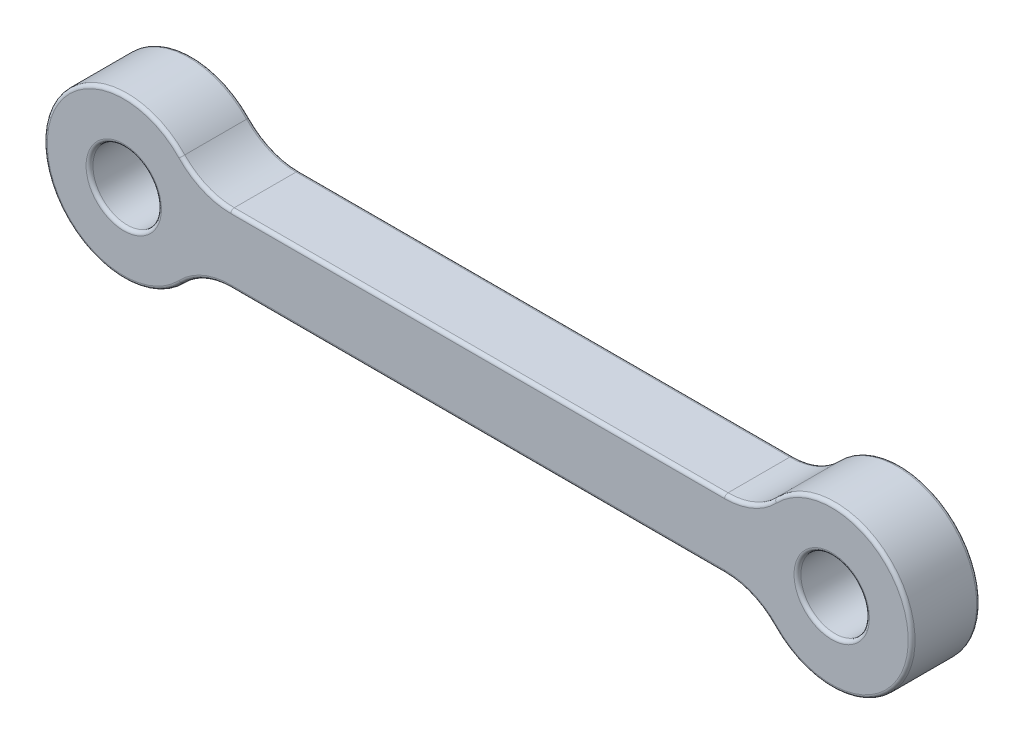
ISO-10303-21;
HEADER;
FILE_DESCRIPTION(('STEP AP214'),'2;1');
FILE_NAME('part.step','',(''),(''),'','','');
FILE_SCHEMA(('AUTOMOTIVE_DESIGN { 1 0 10303 214 1 1 1 1 }'));
ENDSEC;
DATA;
#1=APPLICATION_CONTEXT('core data for automotive mechanical design processes');
#2=APPLICATION_PROTOCOL_DEFINITION('international standard','automotive_design',2000,#1);
#3=PRODUCT_CONTEXT('',#1,'mechanical');
#4=PRODUCT('Part','Part','',(#3));
#5=PRODUCT_RELATED_PRODUCT_CATEGORY('part','',(#4));
#6=PRODUCT_DEFINITION_FORMATION('','',#4);
#7=PRODUCT_DEFINITION_CONTEXT('part definition',#1,'design');
#8=PRODUCT_DEFINITION('design','',#6,#7);
#9=PRODUCT_DEFINITION_SHAPE('','',#8);
#10=(LENGTH_UNIT() NAMED_UNIT(*) SI_UNIT(.MILLI.,.METRE.));
#11=(NAMED_UNIT(*) PLANE_ANGLE_UNIT() SI_UNIT($,.RADIAN.));
#12=(NAMED_UNIT(*) SI_UNIT($,.STERADIAN.) SOLID_ANGLE_UNIT());
#13=UNCERTAINTY_MEASURE_WITH_UNIT(LENGTH_MEASURE(1.E-05),#10,'distance_accuracy_value','');
#14=(GEOMETRIC_REPRESENTATION_CONTEXT(3) GLOBAL_UNCERTAINTY_ASSIGNED_CONTEXT((#13)) GLOBAL_UNIT_ASSIGNED_CONTEXT((#10,
#11,#12)) REPRESENTATION_CONTEXT('',''));
#15=CARTESIAN_POINT('',(0.,0.,0.));
#16=DIRECTION('',(0.,0.,1.));
#17=DIRECTION('',(1.,0.,0.));
#18=AXIS2_PLACEMENT_3D('',#15,#16,#17);
#19=CARTESIAN_POINT('',(0.,1.5,1.5));
#20=DIRECTION('',(0.,1.,0.));
#21=DIRECTION('',(0.,0.,1.));
#22=AXIS2_PLACEMENT_3D('',#19,#20,#21);
#23=PLANE('',#22);
#24=DIRECTION('',(0.,0.,1.));
#25=VECTOR('',#24,1.);
#26=CARTESIAN_POINT('',(26.3095842401766,1.5,-1.5));
#27=LINE('',#26,#25);
#28=CARTESIAN_POINT('',(26.3095842401766,1.5,1.35));
#29=VERTEX_POINT('',#28);
#30=CARTESIAN_POINT('',(26.3095842401766,1.5,-1.35));
#31=VERTEX_POINT('',#30);
#32=EDGE_CURVE('E315',#29,#31,#27,.F.);
#33=ORIENTED_EDGE('',*,*,#32,.T.);
#34=DIRECTION('',(1.,0.,0.));
#35=VECTOR('',#34,1.);
#36=CARTESIAN_POINT('',(4.69041575982343,1.5,-1.35));
#37=LINE('',#36,#35);
#38=CARTESIAN_POINT('',(4.69041575982343,1.5,-1.35));
#39=VERTEX_POINT('',#38);
#40=EDGE_CURVE('E214',#31,#39,#37,.F.);
#41=ORIENTED_EDGE('',*,*,#40,.T.);
#42=DIRECTION('',(0.,0.,-1.));
#43=VECTOR('',#42,1.);
#44=CARTESIAN_POINT('',(4.69041575982343,1.5,1.5));
#45=LINE('',#44,#43);
#46=CARTESIAN_POINT('',(4.69041575982343,1.5,1.35));
#47=VERTEX_POINT('',#46);
#48=EDGE_CURVE('E312',#39,#47,#45,.F.);
#49=ORIENTED_EDGE('',*,*,#48,.T.);
#50=DIRECTION('',(1.,0.,0.));
#51=VECTOR('',#50,1.);
#52=CARTESIAN_POINT('',(0.,1.5,1.35));
#53=LINE('',#52,#51);
#54=EDGE_CURVE('E212',#47,#29,#53,.T.);
#55=ORIENTED_EDGE('',*,*,#54,.T.);
#56=EDGE_LOOP('',(#33,#41,#49,#55));
#57=FACE_BOUND('',#56,.T.);
#58=ADVANCED_FACE('F34',(#57),#23,.T.);
#59=CARTESIAN_POINT('',(0.,0.,1.5));
#60=DIRECTION('',(0.,0.,-1.));
#61=DIRECTION('',(-1.,0.,0.));
#62=AXIS2_PLACEMENT_3D('',#59,#60,#61);
#63=CYLINDRICAL_SURFACE('',#62,3.5);
#64=DIRECTION('',(0.,0.,-1.));
#65=VECTOR('',#64,1.);
#66=CARTESIAN_POINT('',(2.52560848605877,2.42307692307692,1.5));
#67=LINE('',#66,#65);
#68=CARTESIAN_POINT('',(2.52560848605877,2.42307692307692,1.35));
#69=VERTEX_POINT('',#68);
#70=CARTESIAN_POINT('',(2.52560848605877,2.42307692307692,-1.35));
#71=VERTEX_POINT('',#70);
#72=EDGE_CURVE('E302',#69,#71,#67,.T.);
#73=ORIENTED_EDGE('',*,*,#72,.T.);
#74=CARTESIAN_POINT('',(0.,0.,-1.35));
#75=DIRECTION('',(0.,0.,1.));
#76=DIRECTION('',(1.,0.,0.));
#77=AXIS2_PLACEMENT_3D('',#74,#75,#76);
#78=CIRCLE('',#77,3.5);
#79=CARTESIAN_POINT('',(2.52560848605877,-2.42307692307692,-1.35));
#80=VERTEX_POINT('',#79);
#81=EDGE_CURVE('E222',#71,#80,#78,.T.);
#82=ORIENTED_EDGE('',*,*,#81,.T.);
#83=DIRECTION('',(0.,0.,-1.));
#84=VECTOR('',#83,1.);
#85=CARTESIAN_POINT('',(2.52560848605877,-2.42307692307692,1.5));
#86=LINE('',#85,#84);
#87=CARTESIAN_POINT('',(2.52560848605877,-2.42307692307692,1.35));
#88=VERTEX_POINT('',#87);
#89=EDGE_CURVE('E294',#80,#88,#86,.F.);
#90=ORIENTED_EDGE('',*,*,#89,.T.);
#91=CARTESIAN_POINT('',(0.,0.,1.35));
#92=DIRECTION('',(0.,0.,1.));
#93=DIRECTION('',(1.,0.,0.));
#94=AXIS2_PLACEMENT_3D('',#91,#92,#93);
#95=CIRCLE('',#94,3.5);
#96=EDGE_CURVE('E220',#88,#69,#95,.F.);
#97=ORIENTED_EDGE('',*,*,#96,.T.);
#98=EDGE_LOOP('',(#73,#82,#90,#97));
#99=FACE_BOUND('',#98,.T.);
#100=ADVANCED_FACE('F299',(#99),#63,.T.);
#101=CARTESIAN_POINT('',(0.,-1.5,1.5));
#102=DIRECTION('',(0.,1.,0.));
#103=DIRECTION('',(0.,0.,1.));
#104=AXIS2_PLACEMENT_3D('',#101,#102,#103);
#105=PLANE('',#104);
#106=DIRECTION('',(0.,0.,1.));
#107=VECTOR('',#106,1.);
#108=CARTESIAN_POINT('',(4.69041575982343,-1.5,-1.5));
#109=LINE('',#108,#107);
#110=CARTESIAN_POINT('',(4.69041575982343,-1.5,1.35));
#111=VERTEX_POINT('',#110);
#112=CARTESIAN_POINT('',(4.69041575982343,-1.5,-1.35));
#113=VERTEX_POINT('',#112);
#114=EDGE_CURVE('E296',#111,#113,#109,.F.);
#115=ORIENTED_EDGE('',*,*,#114,.T.);
#116=DIRECTION('',(1.,0.,0.));
#117=VECTOR('',#116,1.);
#118=CARTESIAN_POINT('',(0.,-1.5,-1.35));
#119=LINE('',#118,#117);
#120=CARTESIAN_POINT('',(26.3095842401766,-1.5,-1.35));
#121=VERTEX_POINT('',#120);
#122=EDGE_CURVE('E197',#113,#121,#119,.T.);
#123=ORIENTED_EDGE('',*,*,#122,.T.);
#124=DIRECTION('',(0.,0.,-1.));
#125=VECTOR('',#124,1.);
#126=CARTESIAN_POINT('',(26.3095842401766,-1.5,1.5));
#127=LINE('',#126,#125);
#128=CARTESIAN_POINT('',(26.3095842401766,-1.5,1.35));
#129=VERTEX_POINT('',#128);
#130=EDGE_CURVE('E257',#121,#129,#127,.F.);
#131=ORIENTED_EDGE('',*,*,#130,.T.);
#132=DIRECTION('',(1.,0.,0.));
#133=VECTOR('',#132,1.);
#134=CARTESIAN_POINT('',(4.69041575982343,-1.5,1.35));
#135=LINE('',#134,#133);
#136=EDGE_CURVE('E195',#129,#111,#135,.F.);
#137=ORIENTED_EDGE('',*,*,#136,.T.);
#138=EDGE_LOOP('',(#115,#123,#131,#137));
#139=FACE_BOUND('',#138,.T.);
#140=ADVANCED_FACE('F342',(#139),#105,.F.);
#141=CARTESIAN_POINT('',(0.,0.,1.5));
#142=DIRECTION('',(0.,0.,-1.));
#143=DIRECTION('',(-1.,0.,0.));
#144=AXIS2_PLACEMENT_3D('',#141,#142,#143);
#145=CYLINDRICAL_SURFACE('',#144,1.5);
#146=CARTESIAN_POINT('',(0.,0.,-1.35));
#147=DIRECTION('',(0.,0.,1.));
#148=DIRECTION('',(1.,0.,0.));
#149=AXIS2_PLACEMENT_3D('',#146,#147,#148);
#150=CIRCLE('',#149,1.5);
#151=CARTESIAN_POINT('',(1.5,0.,-1.35));
#152=VERTEX_POINT('',#151);
#153=EDGE_CURVE('E189',#152,#152,#150,.F.);
#154=ORIENTED_EDGE('',*,*,#153,.T.);
#155=EDGE_LOOP('',(#154));
#156=FACE_BOUND('',#155,.T.);
#157=CARTESIAN_POINT('',(0.,0.,1.35));
#158=DIRECTION('',(0.,0.,1.));
#159=DIRECTION('',(1.,0.,0.));
#160=AXIS2_PLACEMENT_3D('',#157,#158,#159);
#161=CIRCLE('',#160,1.5);
#162=CARTESIAN_POINT('',(1.5,0.,1.35));
#163=VERTEX_POINT('',#162);
#164=EDGE_CURVE('E186',#163,#163,#161,.T.);
#165=ORIENTED_EDGE('',*,*,#164,.T.);
#166=EDGE_LOOP('',(#165));
#167=FACE_BOUND('',#166,.T.);
#168=ADVANCED_FACE('F389',(#156,#167),#145,.F.);
#169=CARTESIAN_POINT('',(31.,0.,1.5));
#170=DIRECTION('',(0.,0.,-1.));
#171=DIRECTION('',(-1.,0.,0.));
#172=AXIS2_PLACEMENT_3D('',#169,#170,#171);
#173=CYLINDRICAL_SURFACE('',#172,3.5);
#174=DIRECTION('',(0.,0.,-1.));
#175=VECTOR('',#174,1.);
#176=CARTESIAN_POINT('',(28.4743915139412,-2.42307692307692,1.5));
#177=LINE('',#176,#175);
#178=CARTESIAN_POINT('',(28.4743915139412,-2.42307692307692,1.35));
#179=VERTEX_POINT('',#178);
#180=CARTESIAN_POINT('',(28.4743915139412,-2.42307692307692,-1.35));
#181=VERTEX_POINT('',#180);
#182=EDGE_CURVE('E305',#179,#181,#177,.T.);
#183=ORIENTED_EDGE('',*,*,#182,.T.);
#184=CARTESIAN_POINT('',(31.,0.,-1.35));
#185=DIRECTION('',(0.,0.,1.));
#186=DIRECTION('',(1.,0.,0.));
#187=AXIS2_PLACEMENT_3D('',#184,#185,#186);
#188=CIRCLE('',#187,3.5);
#189=CARTESIAN_POINT('',(28.4743915139412,2.42307692307692,-1.35));
#190=VERTEX_POINT('',#189);
#191=EDGE_CURVE('E205',#181,#190,#188,.T.);
#192=ORIENTED_EDGE('',*,*,#191,.T.);
#193=DIRECTION('',(0.,0.,-1.));
#194=VECTOR('',#193,1.);
#195=CARTESIAN_POINT('',(28.4743915139412,2.42307692307692,1.5));
#196=LINE('',#195,#194);
#197=CARTESIAN_POINT('',(28.4743915139412,2.42307692307692,1.35));
#198=VERTEX_POINT('',#197);
#199=EDGE_CURVE('E301',#190,#198,#196,.F.);
#200=ORIENTED_EDGE('',*,*,#199,.T.);
#201=CARTESIAN_POINT('',(31.,0.,1.35));
#202=DIRECTION('',(0.,0.,1.));
#203=DIRECTION('',(1.,0.,0.));
#204=AXIS2_PLACEMENT_3D('',#201,#202,#203);
#205=CIRCLE('',#204,3.5);
#206=EDGE_CURVE('E203',#198,#179,#205,.F.);
#207=ORIENTED_EDGE('',*,*,#206,.T.);
#208=EDGE_LOOP('',(#183,#192,#200,#207));
#209=FACE_BOUND('',#208,.T.);
#210=ADVANCED_FACE('F386',(#209),#173,.T.);
#211=CARTESIAN_POINT('',(31.,0.,1.5));
#212=DIRECTION('',(0.,0.,-1.));
#213=DIRECTION('',(-1.,0.,0.));
#214=AXIS2_PLACEMENT_3D('',#211,#212,#213);
#215=CYLINDRICAL_SURFACE('',#214,1.5);
#216=CARTESIAN_POINT('',(31.,0.,-1.35));
#217=DIRECTION('',(0.,0.,1.));
#218=DIRECTION('',(1.,0.,0.));
#219=AXIS2_PLACEMENT_3D('',#216,#217,#218);
#220=CIRCLE('',#219,1.5);
#221=CARTESIAN_POINT('',(32.5,0.,-1.35));
#222=VERTEX_POINT('',#221);
#223=EDGE_CURVE('E169',#222,#222,#220,.F.);
#224=ORIENTED_EDGE('',*,*,#223,.T.);
#225=EDGE_LOOP('',(#224));
#226=FACE_BOUND('',#225,.T.);
#227=CARTESIAN_POINT('',(31.,0.,1.35));
#228=DIRECTION('',(0.,0.,1.));
#229=DIRECTION('',(1.,0.,0.));
#230=AXIS2_PLACEMENT_3D('',#227,#228,#229);
#231=CIRCLE('',#230,1.5);
#232=CARTESIAN_POINT('',(32.5,0.,1.35));
#233=VERTEX_POINT('',#232);
#234=EDGE_CURVE('E318',#233,#233,#231,.T.);
#235=ORIENTED_EDGE('',*,*,#234,.T.);
#236=EDGE_LOOP('',(#235));
#237=FACE_BOUND('',#236,.T.);
#238=ADVANCED_FACE('F388',(#226,#237),#215,.F.);
#239=CARTESIAN_POINT('',(0.,0.,1.5));
#240=DIRECTION('',(0.,0.,1.));
#241=DIRECTION('',(1.,0.,0.));
#242=AXIS2_PLACEMENT_3D('',#239,#240,#241);
#243=PLANE('',#242);
#244=CARTESIAN_POINT('',(31.,0.,1.5));
#245=DIRECTION('',(0.,0.,1.));
#246=DIRECTION('',(1.,0.,0.));
#247=AXIS2_PLACEMENT_3D('',#244,#245,#246);
#248=CIRCLE('',#247,1.65);
#249=CARTESIAN_POINT('',(32.65,0.,1.5));
#250=VERTEX_POINT('',#249);
#251=EDGE_CURVE('E11',#250,#250,#248,.F.);
#252=ORIENTED_EDGE('',*,*,#251,.T.);
#253=EDGE_LOOP('',(#252));
#254=FACE_BOUND('',#253,.T.);
#255=CARTESIAN_POINT('',(0.,0.,1.5));
#256=DIRECTION('',(0.,0.,1.));
#257=DIRECTION('',(1.,0.,0.));
#258=AXIS2_PLACEMENT_3D('',#255,#256,#257);
#259=CIRCLE('',#258,1.65);
#260=CARTESIAN_POINT('',(1.65,0.,1.5));
#261=VERTEX_POINT('',#260);
#262=EDGE_CURVE('E43',#261,#261,#259,.F.);
#263=ORIENTED_EDGE('',*,*,#262,.T.);
#264=EDGE_LOOP('',(#263));
#265=FACE_BOUND('',#264,.T.);
#266=CARTESIAN_POINT('',(31.,0.,1.5));
#267=DIRECTION('',(0.,0.,1.));
#268=DIRECTION('',(1.,0.,0.));
#269=AXIS2_PLACEMENT_3D('',#266,#267,#268);
#270=CIRCLE('',#269,3.35);
#271=CARTESIAN_POINT('',(28.5826318776295,-2.31923076923077,1.5));
#272=VERTEX_POINT('',#271);
#273=CARTESIAN_POINT('',(28.5826318776295,2.31923076923077,1.5));
#274=VERTEX_POINT('',#273);
#275=EDGE_CURVE('E51',#272,#274,#270,.T.);
#276=ORIENTED_EDGE('',*,*,#275,.T.);
#277=CARTESIAN_POINT('',(26.3095842401766,4.5,1.5));
#278=DIRECTION('',(0.,0.,1.));
#279=DIRECTION('',(1.,0.,0.));
#280=AXIS2_PLACEMENT_3D('',#277,#278,#279);
#281=CIRCLE('',#280,3.15);
#282=CARTESIAN_POINT('',(26.3095842401766,1.35,1.5));
#283=VERTEX_POINT('',#282);
#284=EDGE_CURVE('E236',#274,#283,#281,.F.);
#285=ORIENTED_EDGE('',*,*,#284,.T.);
#286=DIRECTION('',(1.,0.,0.));
#287=VECTOR('',#286,1.);
#288=CARTESIAN_POINT('',(0.,1.35,1.5));
#289=LINE('',#288,#287);
#290=CARTESIAN_POINT('',(4.69041575982343,1.35,1.5));
#291=VERTEX_POINT('',#290);
#292=EDGE_CURVE('E224',#283,#291,#289,.F.);
#293=ORIENTED_EDGE('',*,*,#292,.T.);
#294=CARTESIAN_POINT('',(4.69041575982343,4.5,1.5));
#295=DIRECTION('',(0.,0.,1.));
#296=DIRECTION('',(1.,0.,0.));
#297=AXIS2_PLACEMENT_3D('',#294,#295,#296);
#298=CIRCLE('',#297,3.15);
#299=CARTESIAN_POINT('',(2.41736812237054,2.31923076923077,1.5));
#300=VERTEX_POINT('',#299);
#301=EDGE_CURVE('E226',#291,#300,#298,.F.);
#302=ORIENTED_EDGE('',*,*,#301,.T.);
#303=CARTESIAN_POINT('',(0.,0.,1.5));
#304=DIRECTION('',(0.,0.,1.));
#305=DIRECTION('',(1.,0.,0.));
#306=AXIS2_PLACEMENT_3D('',#303,#304,#305);
#307=CIRCLE('',#306,3.35);
#308=CARTESIAN_POINT('',(2.41736812237054,-2.31923076923077,1.5));
#309=VERTEX_POINT('',#308);
#310=EDGE_CURVE('E228',#300,#309,#307,.T.);
#311=ORIENTED_EDGE('',*,*,#310,.T.);
#312=CARTESIAN_POINT('',(4.69041575982343,-4.5,1.5));
#313=DIRECTION('',(0.,0.,1.));
#314=DIRECTION('',(1.,0.,0.));
#315=AXIS2_PLACEMENT_3D('',#312,#313,#314);
#316=CIRCLE('',#315,3.15);
#317=CARTESIAN_POINT('',(4.69041575982343,-1.35,1.5));
#318=VERTEX_POINT('',#317);
#319=EDGE_CURVE('E230',#309,#318,#316,.F.);
#320=ORIENTED_EDGE('',*,*,#319,.T.);
#321=DIRECTION('',(1.,0.,0.));
#322=VECTOR('',#321,1.);
#323=CARTESIAN_POINT('',(26.3095842401766,-1.35,1.5));
#324=LINE('',#323,#322);
#325=CARTESIAN_POINT('',(26.3095842401766,-1.35,1.5));
#326=VERTEX_POINT('',#325);
#327=EDGE_CURVE('E232',#318,#326,#324,.T.);
#328=ORIENTED_EDGE('',*,*,#327,.T.);
#329=CARTESIAN_POINT('',(26.3095842401766,-4.5,1.5));
#330=DIRECTION('',(0.,0.,1.));
#331=DIRECTION('',(1.,0.,0.));
#332=AXIS2_PLACEMENT_3D('',#329,#330,#331);
#333=CIRCLE('',#332,3.15);
#334=EDGE_CURVE('E56',#326,#272,#333,.F.);
#335=ORIENTED_EDGE('',*,*,#334,.T.);
#336=EDGE_LOOP('',(#276,#285,#293,#302,#311,#320,#328,#335));
#337=FACE_BOUND('',#336,.T.);
#338=ADVANCED_FACE('F359',(#254,#265,#337),#243,.T.);
#339=CARTESIAN_POINT('',(0.,0.,-1.5));
#340=DIRECTION('',(0.,0.,1.));
#341=DIRECTION('',(1.,0.,0.));
#342=AXIS2_PLACEMENT_3D('',#339,#340,#341);
#343=PLANE('',#342);
#344=CARTESIAN_POINT('',(31.,0.,-1.5));
#345=DIRECTION('',(0.,0.,1.));
#346=DIRECTION('',(1.,0.,0.));
#347=AXIS2_PLACEMENT_3D('',#344,#345,#346);
#348=CIRCLE('',#347,1.65);
#349=CARTESIAN_POINT('',(32.65,0.,-1.5));
#350=VERTEX_POINT('',#349);
#351=EDGE_CURVE('E178',#350,#350,#348,.T.);
#352=ORIENTED_EDGE('',*,*,#351,.T.);
#353=EDGE_LOOP('',(#352));
#354=FACE_BOUND('',#353,.T.);
#355=CARTESIAN_POINT('',(0.,0.,-1.5));
#356=DIRECTION('',(0.,0.,1.));
#357=DIRECTION('',(1.,0.,0.));
#358=AXIS2_PLACEMENT_3D('',#355,#356,#357);
#359=CIRCLE('',#358,1.65);
#360=CARTESIAN_POINT('',(1.65,0.,-1.5));
#361=VERTEX_POINT('',#360);
#362=EDGE_CURVE('E175',#361,#361,#359,.T.);
#363=ORIENTED_EDGE('',*,*,#362,.T.);
#364=EDGE_LOOP('',(#363));
#365=FACE_BOUND('',#364,.T.);
#366=DIRECTION('',(1.,0.,0.));
#367=VECTOR('',#366,1.);
#368=CARTESIAN_POINT('',(0.,-1.35,-1.5));
#369=LINE('',#368,#367);
#370=CARTESIAN_POINT('',(26.3095842401766,-1.35,-1.5));
#371=VERTEX_POINT('',#370);
#372=CARTESIAN_POINT('',(4.69041575982343,-1.35,-1.5));
#373=VERTEX_POINT('',#372);
#374=EDGE_CURVE('E173',#371,#373,#369,.F.);
#375=ORIENTED_EDGE('',*,*,#374,.T.);
#376=CARTESIAN_POINT('',(4.69041575982343,-4.5,-1.5));
#377=DIRECTION('',(0.,0.,1.));
#378=DIRECTION('',(1.,0.,0.));
#379=AXIS2_PLACEMENT_3D('',#376,#377,#378);
#380=CIRCLE('',#379,3.15);
#381=CARTESIAN_POINT('',(2.41736812237054,-2.31923076923077,-1.5));
#382=VERTEX_POINT('',#381);
#383=EDGE_CURVE('E154',#373,#382,#380,.T.);
#384=ORIENTED_EDGE('',*,*,#383,.T.);
#385=CARTESIAN_POINT('',(0.,0.,-1.5));
#386=DIRECTION('',(0.,0.,1.));
#387=DIRECTION('',(1.,0.,0.));
#388=AXIS2_PLACEMENT_3D('',#385,#386,#387);
#389=CIRCLE('',#388,3.35);
#390=CARTESIAN_POINT('',(2.41736812237054,2.31923076923077,-1.5));
#391=VERTEX_POINT('',#390);
#392=EDGE_CURVE('E162',#382,#391,#389,.F.);
#393=ORIENTED_EDGE('',*,*,#392,.T.);
#394=CARTESIAN_POINT('',(4.69041575982343,4.5,-1.5));
#395=DIRECTION('',(0.,0.,1.));
#396=DIRECTION('',(1.,0.,0.));
#397=AXIS2_PLACEMENT_3D('',#394,#395,#396);
#398=CIRCLE('',#397,3.15);
#399=CARTESIAN_POINT('',(4.69041575982343,1.35,-1.5));
#400=VERTEX_POINT('',#399);
#401=EDGE_CURVE('E168',#391,#400,#398,.T.);
#402=ORIENTED_EDGE('',*,*,#401,.T.);
#403=DIRECTION('',(1.,0.,0.));
#404=VECTOR('',#403,1.);
#405=CARTESIAN_POINT('',(26.3095842401766,1.35,-1.5));
#406=LINE('',#405,#404);
#407=CARTESIAN_POINT('',(26.3095842401766,1.35,-1.5));
#408=VERTEX_POINT('',#407);
#409=EDGE_CURVE('E324',#400,#408,#406,.T.);
#410=ORIENTED_EDGE('',*,*,#409,.T.);
#411=CARTESIAN_POINT('',(26.3095842401766,4.5,-1.5));
#412=DIRECTION('',(0.,0.,1.));
#413=DIRECTION('',(1.,0.,0.));
#414=AXIS2_PLACEMENT_3D('',#411,#412,#413);
#415=CIRCLE('',#414,3.15);
#416=CARTESIAN_POINT('',(28.5826318776295,2.31923076923077,-1.5));
#417=VERTEX_POINT('',#416);
#418=EDGE_CURVE('E326',#408,#417,#415,.T.);
#419=ORIENTED_EDGE('',*,*,#418,.T.);
#420=CARTESIAN_POINT('',(31.,0.,-1.5));
#421=DIRECTION('',(0.,0.,1.));
#422=DIRECTION('',(1.,0.,0.));
#423=AXIS2_PLACEMENT_3D('',#420,#421,#422);
#424=CIRCLE('',#423,3.35);
#425=CARTESIAN_POINT('',(28.5826318776295,-2.31923076923077,-1.5));
#426=VERTEX_POINT('',#425);
#427=EDGE_CURVE('E328',#417,#426,#424,.F.);
#428=ORIENTED_EDGE('',*,*,#427,.T.);
#429=CARTESIAN_POINT('',(26.3095842401766,-4.5,-1.5));
#430=DIRECTION('',(0.,0.,1.));
#431=DIRECTION('',(1.,0.,0.));
#432=AXIS2_PLACEMENT_3D('',#429,#430,#431);
#433=CIRCLE('',#432,3.15);
#434=EDGE_CURVE('E180',#426,#371,#433,.T.);
#435=ORIENTED_EDGE('',*,*,#434,.T.);
#436=EDGE_LOOP('',(#375,#384,#393,#402,#410,#419,#428,#435));
#437=FACE_BOUND('',#436,.T.);
#438=ADVANCED_FACE('F171',(#354,#365,#437),#343,.F.);
#439=CARTESIAN_POINT('',(4.69041575982343,-4.5,1.5));
#440=DIRECTION('',(0.,0.,-1.));
#441=DIRECTION('',(-1.,0.,0.));
#442=AXIS2_PLACEMENT_3D('',#439,#440,#441);
#443=CYLINDRICAL_SURFACE('',#442,3.);
#444=ORIENTED_EDGE('',*,*,#89,.F.);
#445=CARTESIAN_POINT('',(4.69041575982343,-4.5,-1.35));
#446=DIRECTION('',(0.,0.,1.));
#447=DIRECTION('',(1.,0.,0.));
#448=AXIS2_PLACEMENT_3D('',#445,#446,#447);
#449=CIRCLE('',#448,3.);
#450=EDGE_CURVE('E156',#80,#113,#449,.F.);
#451=ORIENTED_EDGE('',*,*,#450,.T.);
#452=ORIENTED_EDGE('',*,*,#114,.F.);
#453=CARTESIAN_POINT('',(4.69041575982343,-4.5,1.35));
#454=DIRECTION('',(0.,0.,1.));
#455=DIRECTION('',(1.,0.,0.));
#456=AXIS2_PLACEMENT_3D('',#453,#454,#455);
#457=CIRCLE('',#456,3.);
#458=EDGE_CURVE('E192',#111,#88,#457,.T.);
#459=ORIENTED_EDGE('',*,*,#458,.T.);
#460=EDGE_LOOP('',(#444,#451,#452,#459));
#461=FACE_BOUND('',#460,.T.);
#462=ADVANCED_FACE('F293',(#461),#443,.F.);
#463=CARTESIAN_POINT('',(26.3095842401766,-4.5,1.5));
#464=DIRECTION('',(0.,0.,-1.));
#465=DIRECTION('',(-1.,0.,0.));
#466=AXIS2_PLACEMENT_3D('',#463,#464,#465);
#467=CYLINDRICAL_SURFACE('',#466,3.);
#468=ORIENTED_EDGE('',*,*,#130,.F.);
#469=CARTESIAN_POINT('',(26.3095842401766,-4.5,-1.35));
#470=DIRECTION('',(0.,0.,1.));
#471=DIRECTION('',(1.,0.,0.));
#472=AXIS2_PLACEMENT_3D('',#469,#470,#471);
#473=CIRCLE('',#472,3.);
#474=EDGE_CURVE('E201',#121,#181,#473,.F.);
#475=ORIENTED_EDGE('',*,*,#474,.T.);
#476=ORIENTED_EDGE('',*,*,#182,.F.);
#477=CARTESIAN_POINT('',(26.3095842401766,-4.5,1.35));
#478=DIRECTION('',(0.,0.,1.));
#479=DIRECTION('',(1.,0.,0.));
#480=AXIS2_PLACEMENT_3D('',#477,#478,#479);
#481=CIRCLE('',#480,3.);
#482=EDGE_CURVE('E199',#179,#129,#481,.T.);
#483=ORIENTED_EDGE('',*,*,#482,.T.);
#484=EDGE_LOOP('',(#468,#475,#476,#483));
#485=FACE_BOUND('',#484,.T.);
#486=ADVANCED_FACE('F345',(#485),#467,.F.);
#487=CARTESIAN_POINT('',(26.3095842401766,4.5,1.5));
#488=DIRECTION('',(0.,0.,-1.));
#489=DIRECTION('',(-1.,0.,0.));
#490=AXIS2_PLACEMENT_3D('',#487,#488,#489);
#491=CYLINDRICAL_SURFACE('',#490,3.);
#492=ORIENTED_EDGE('',*,*,#199,.F.);
#493=CARTESIAN_POINT('',(26.3095842401766,4.5,-1.35));
#494=DIRECTION('',(0.,0.,1.));
#495=DIRECTION('',(1.,0.,0.));
#496=AXIS2_PLACEMENT_3D('',#493,#494,#495);
#497=CIRCLE('',#496,3.);
#498=EDGE_CURVE('E210',#190,#31,#497,.F.);
#499=ORIENTED_EDGE('',*,*,#498,.T.);
#500=ORIENTED_EDGE('',*,*,#32,.F.);
#501=CARTESIAN_POINT('',(26.3095842401766,4.5,1.35));
#502=DIRECTION('',(0.,0.,1.));
#503=DIRECTION('',(1.,0.,0.));
#504=AXIS2_PLACEMENT_3D('',#501,#502,#503);
#505=CIRCLE('',#504,3.);
#506=EDGE_CURVE('E207',#29,#198,#505,.T.);
#507=ORIENTED_EDGE('',*,*,#506,.T.);
#508=EDGE_LOOP('',(#492,#499,#500,#507));
#509=FACE_BOUND('',#508,.T.);
#510=ADVANCED_FACE('F375',(#509),#491,.F.);
#511=CARTESIAN_POINT('',(4.69041575982343,4.5,1.5));
#512=DIRECTION('',(0.,0.,-1.));
#513=DIRECTION('',(-1.,0.,0.));
#514=AXIS2_PLACEMENT_3D('',#511,#512,#513);
#515=CYLINDRICAL_SURFACE('',#514,3.);
#516=ORIENTED_EDGE('',*,*,#48,.F.);
#517=CARTESIAN_POINT('',(4.69041575982343,4.5,-1.35));
#518=DIRECTION('',(0.,0.,1.));
#519=DIRECTION('',(1.,0.,0.));
#520=AXIS2_PLACEMENT_3D('',#517,#518,#519);
#521=CIRCLE('',#520,3.);
#522=EDGE_CURVE('E218',#39,#71,#521,.F.);
#523=ORIENTED_EDGE('',*,*,#522,.T.);
#524=ORIENTED_EDGE('',*,*,#72,.F.);
#525=CARTESIAN_POINT('',(4.69041575982343,4.5,1.35));
#526=DIRECTION('',(0.,0.,1.));
#527=DIRECTION('',(1.,0.,0.));
#528=AXIS2_PLACEMENT_3D('',#525,#526,#527);
#529=CIRCLE('',#528,3.);
#530=EDGE_CURVE('E216',#69,#47,#529,.T.);
#531=ORIENTED_EDGE('',*,*,#530,.T.);
#532=EDGE_LOOP('',(#516,#523,#524,#531));
#533=FACE_BOUND('',#532,.T.);
#534=ADVANCED_FACE('F413',(#533),#515,.F.);
#535=CARTESIAN_POINT('',(31.,0.,-1.35));
#536=DIRECTION('',(0.,0.,1.));
#537=DIRECTION('',(1.,0.,0.));
#538=AXIS2_PLACEMENT_3D('',#535,#536,#537);
#539=TOROIDAL_SURFACE('',#538,1.65,0.15);
#540=ORIENTED_EDGE('',*,*,#351,.F.);
#541=EDGE_LOOP('',(#540));
#542=FACE_BOUND('',#541,.T.);
#543=ORIENTED_EDGE('',*,*,#223,.F.);
#544=EDGE_LOOP('',(#543));
#545=FACE_BOUND('',#544,.T.);
#546=ADVANCED_FACE('F416',(#542,#545),#539,.T.);
#547=CARTESIAN_POINT('',(0.,0.,-1.35));
#548=DIRECTION('',(0.,0.,1.));
#549=DIRECTION('',(1.,0.,0.));
#550=AXIS2_PLACEMENT_3D('',#547,#548,#549);
#551=TOROIDAL_SURFACE('',#550,1.65,0.15);
#552=ORIENTED_EDGE('',*,*,#153,.F.);
#553=EDGE_LOOP('',(#552));
#554=FACE_BOUND('',#553,.T.);
#555=ORIENTED_EDGE('',*,*,#362,.F.);
#556=EDGE_LOOP('',(#555));
#557=FACE_BOUND('',#556,.T.);
#558=ADVANCED_FACE('F420',(#554,#557),#551,.T.);
#559=CARTESIAN_POINT('',(26.3095842401766,4.5,-1.35));
#560=DIRECTION('',(0.,0.,1.));
#561=DIRECTION('',(1.,0.,0.));
#562=AXIS2_PLACEMENT_3D('',#559,#560,#561);
#563=TOROIDAL_SURFACE('',#562,3.15,0.15);
#564=CARTESIAN_POINT('',(26.3095842401766,1.35,-1.35));
#565=DIRECTION('',(-1.,0.,0.));
#566=DIRECTION('',(0.,0.,1.));
#567=AXIS2_PLACEMENT_3D('',#564,#565,#566);
#568=CIRCLE('',#567,0.15);
#569=EDGE_CURVE('E251',#31,#408,#568,.T.);
#570=ORIENTED_EDGE('',*,*,#569,.F.);
#571=ORIENTED_EDGE('',*,*,#498,.F.);
#572=CARTESIAN_POINT('',(28.5826318776295,2.31923076923077,-1.35));
#573=DIRECTION('',(0.692307692307703,0.72160242458821,0.));
#574=DIRECTION('',(-0.72160242458821,0.692307692307703,0.));
#575=AXIS2_PLACEMENT_3D('',#572,#573,#574);
#576=CIRCLE('',#575,0.15);
#577=EDGE_CURVE('E254',#417,#190,#576,.T.);
#578=ORIENTED_EDGE('',*,*,#577,.F.);
#579=ORIENTED_EDGE('',*,*,#418,.F.);
#580=EDGE_LOOP('',(#570,#571,#578,#579));
#581=FACE_BOUND('',#580,.T.);
#582=ADVANCED_FACE('F379',(#581),#563,.T.);
#583=CARTESIAN_POINT('',(31.,0.,-1.35));
#584=DIRECTION('',(0.,0.,1.));
#585=DIRECTION('',(1.,0.,0.));
#586=AXIS2_PLACEMENT_3D('',#583,#584,#585);
#587=TOROIDAL_SURFACE('',#586,3.35,0.15);
#588=ORIENTED_EDGE('',*,*,#577,.T.);
#589=ORIENTED_EDGE('',*,*,#191,.F.);
#590=CARTESIAN_POINT('',(28.5826318776295,-2.31923076923077,-1.35));
#591=DIRECTION('',(-0.692307692307698,0.721602424588214,0.));
#592=DIRECTION('',(-0.721602424588214,-0.692307692307698,0.));
#593=AXIS2_PLACEMENT_3D('',#590,#591,#592);
#594=CIRCLE('',#593,0.15);
#595=EDGE_CURVE('E248',#426,#181,#594,.T.);
#596=ORIENTED_EDGE('',*,*,#595,.F.);
#597=ORIENTED_EDGE('',*,*,#427,.F.);
#598=EDGE_LOOP('',(#588,#589,#596,#597));
#599=FACE_BOUND('',#598,.T.);
#600=ADVANCED_FACE('F384',(#599),#587,.T.);
#601=CARTESIAN_POINT('',(0.,1.35,-1.35));
#602=DIRECTION('',(-1.,0.,0.));
#603=DIRECTION('',(0.,0.,1.));
#604=AXIS2_PLACEMENT_3D('',#601,#602,#603);
#605=CYLINDRICAL_SURFACE('',#604,0.15);
#606=ORIENTED_EDGE('',*,*,#569,.T.);
#607=ORIENTED_EDGE('',*,*,#409,.F.);
#608=CARTESIAN_POINT('',(4.69041575982343,1.35,-1.35));
#609=DIRECTION('',(-1.,0.,0.));
#610=DIRECTION('',(0.,0.,1.));
#611=AXIS2_PLACEMENT_3D('',#608,#609,#610);
#612=CIRCLE('',#611,0.15);
#613=EDGE_CURVE('E245',#39,#400,#612,.T.);
#614=ORIENTED_EDGE('',*,*,#613,.F.);
#615=ORIENTED_EDGE('',*,*,#40,.F.);
#616=EDGE_LOOP('',(#606,#607,#614,#615));
#617=FACE_BOUND('',#616,.T.);
#618=ADVANCED_FACE('F438',(#617),#605,.T.);
#619=CARTESIAN_POINT('',(26.3095842401766,-4.5,-1.35));
#620=DIRECTION('',(0.,0.,1.));
#621=DIRECTION('',(1.,0.,0.));
#622=AXIS2_PLACEMENT_3D('',#619,#620,#621);
#623=TOROIDAL_SURFACE('',#622,3.15,0.15);
#624=ORIENTED_EDGE('',*,*,#595,.T.);
#625=ORIENTED_EDGE('',*,*,#474,.F.);
#626=CARTESIAN_POINT('',(26.3095842401766,-1.35,-1.35));
#627=DIRECTION('',(-1.,0.,0.));
#628=DIRECTION('',(0.,0.,1.));
#629=AXIS2_PLACEMENT_3D('',#626,#627,#628);
#630=CIRCLE('',#629,0.15);
#631=EDGE_CURVE('E242',#371,#121,#630,.T.);
#632=ORIENTED_EDGE('',*,*,#631,.F.);
#633=ORIENTED_EDGE('',*,*,#434,.F.);
#634=EDGE_LOOP('',(#624,#625,#632,#633));
#635=FACE_BOUND('',#634,.T.);
#636=ADVANCED_FACE('F335',(#635),#623,.T.);
#637=CARTESIAN_POINT('',(4.69041575982343,4.5,-1.35));
#638=DIRECTION('',(0.,0.,1.));
#639=DIRECTION('',(1.,0.,0.));
#640=AXIS2_PLACEMENT_3D('',#637,#638,#639);
#641=TOROIDAL_SURFACE('',#640,3.15,0.15);
#642=ORIENTED_EDGE('',*,*,#613,.T.);
#643=ORIENTED_EDGE('',*,*,#401,.F.);
#644=CARTESIAN_POINT('',(2.41736812237054,2.31923076923077,-1.35));
#645=DIRECTION('',(-0.692307692307693,0.72160242458822,0.));
#646=DIRECTION('',(-0.72160242458822,-0.692307692307693,0.));
#647=AXIS2_PLACEMENT_3D('',#644,#645,#646);
#648=CIRCLE('',#647,0.15);
#649=EDGE_CURVE('E165',#71,#391,#648,.T.);
#650=ORIENTED_EDGE('',*,*,#649,.F.);
#651=ORIENTED_EDGE('',*,*,#522,.F.);
#652=EDGE_LOOP('',(#642,#643,#650,#651));
#653=FACE_BOUND('',#652,.T.);
#654=ADVANCED_FACE('F432',(#653),#641,.T.);
#655=CARTESIAN_POINT('',(0.,-1.35,-1.35));
#656=DIRECTION('',(1.,0.,0.));
#657=DIRECTION('',(0.,0.,-1.));
#658=AXIS2_PLACEMENT_3D('',#655,#656,#657);
#659=CYLINDRICAL_SURFACE('',#658,0.15);
#660=ORIENTED_EDGE('',*,*,#631,.T.);
#661=ORIENTED_EDGE('',*,*,#122,.F.);
#662=CARTESIAN_POINT('',(4.69041575982343,-1.35,-1.35));
#663=DIRECTION('',(-1.,0.,0.));
#664=DIRECTION('',(0.,0.,1.));
#665=AXIS2_PLACEMENT_3D('',#662,#663,#664);
#666=CIRCLE('',#665,0.15);
#667=EDGE_CURVE('E159',#373,#113,#666,.T.);
#668=ORIENTED_EDGE('',*,*,#667,.F.);
#669=ORIENTED_EDGE('',*,*,#374,.F.);
#670=EDGE_LOOP('',(#660,#661,#668,#669));
#671=FACE_BOUND('',#670,.T.);
#672=ADVANCED_FACE('F338',(#671),#659,.T.);
#673=CARTESIAN_POINT('',(0.,0.,-1.35));
#674=DIRECTION('',(0.,0.,1.));
#675=DIRECTION('',(1.,0.,0.));
#676=AXIS2_PLACEMENT_3D('',#673,#674,#675);
#677=TOROIDAL_SURFACE('',#676,3.35,0.15);
#678=ORIENTED_EDGE('',*,*,#649,.T.);
#679=ORIENTED_EDGE('',*,*,#392,.F.);
#680=CARTESIAN_POINT('',(2.41736812237054,-2.31923076923077,-1.35));
#681=DIRECTION('',(0.692307692307693,0.72160242458822,0.));
#682=DIRECTION('',(-0.72160242458822,0.692307692307693,0.));
#683=AXIS2_PLACEMENT_3D('',#680,#681,#682);
#684=CIRCLE('',#683,0.15);
#685=EDGE_CURVE('E150',#80,#382,#684,.T.);
#686=ORIENTED_EDGE('',*,*,#685,.F.);
#687=ORIENTED_EDGE('',*,*,#81,.F.);
#688=EDGE_LOOP('',(#678,#679,#686,#687));
#689=FACE_BOUND('',#688,.T.);
#690=ADVANCED_FACE('F163',(#689),#677,.T.);
#691=CARTESIAN_POINT('',(4.69041575982343,-4.5,-1.35));
#692=DIRECTION('',(0.,0.,1.));
#693=DIRECTION('',(1.,0.,0.));
#694=AXIS2_PLACEMENT_3D('',#691,#692,#693);
#695=TOROIDAL_SURFACE('',#694,3.15,0.15);
#696=ORIENTED_EDGE('',*,*,#667,.T.);
#697=ORIENTED_EDGE('',*,*,#450,.F.);
#698=ORIENTED_EDGE('',*,*,#685,.T.);
#699=ORIENTED_EDGE('',*,*,#383,.F.);
#700=EDGE_LOOP('',(#696,#697,#698,#699));
#701=FACE_BOUND('',#700,.T.);
#702=ADVANCED_FACE('F152',(#701),#695,.T.);
#703=CARTESIAN_POINT('',(31.,0.,1.35));
#704=DIRECTION('',(0.,0.,1.));
#705=DIRECTION('',(1.,0.,0.));
#706=AXIS2_PLACEMENT_3D('',#703,#704,#705);
#707=TOROIDAL_SURFACE('',#706,1.65,0.15);
#708=ORIENTED_EDGE('',*,*,#234,.F.);
#709=EDGE_LOOP('',(#708));
#710=FACE_BOUND('',#709,.T.);
#711=ORIENTED_EDGE('',*,*,#251,.F.);
#712=EDGE_LOOP('',(#711));
#713=FACE_BOUND('',#712,.T.);
#714=ADVANCED_FACE('F427',(#710,#713),#707,.T.);
#715=CARTESIAN_POINT('',(0.,0.,1.35));
#716=DIRECTION('',(0.,0.,1.));
#717=DIRECTION('',(1.,0.,0.));
#718=AXIS2_PLACEMENT_3D('',#715,#716,#717);
#719=TOROIDAL_SURFACE('',#718,1.65,0.15);
#720=ORIENTED_EDGE('',*,*,#262,.F.);
#721=EDGE_LOOP('',(#720));
#722=FACE_BOUND('',#721,.T.);
#723=ORIENTED_EDGE('',*,*,#164,.F.);
#724=EDGE_LOOP('',(#723));
#725=FACE_BOUND('',#724,.T.);
#726=ADVANCED_FACE('F448',(#722,#725),#719,.T.);
#727=CARTESIAN_POINT('',(4.69041575982343,-4.5,1.35));
#728=DIRECTION('',(0.,0.,1.));
#729=DIRECTION('',(1.,0.,0.));
#730=AXIS2_PLACEMENT_3D('',#727,#728,#729);
#731=TOROIDAL_SURFACE('',#730,3.15,0.15);
#732=CARTESIAN_POINT('',(2.41736812237054,-2.31923076923077,1.35));
#733=DIRECTION('',(-0.692307692307693,-0.72160242458822,0.));
#734=DIRECTION('',(0.72160242458822,-0.692307692307693,0.));
#735=AXIS2_PLACEMENT_3D('',#732,#733,#734);
#736=CIRCLE('',#735,0.15);
#737=EDGE_CURVE('E273',#88,#309,#736,.T.);
#738=ORIENTED_EDGE('',*,*,#737,.F.);
#739=ORIENTED_EDGE('',*,*,#458,.F.);
#740=CARTESIAN_POINT('',(4.69041575982343,-1.35,1.35));
#741=DIRECTION('',(1.,0.,0.));
#742=DIRECTION('',(0.,0.,-1.));
#743=AXIS2_PLACEMENT_3D('',#740,#741,#742);
#744=CIRCLE('',#743,0.15);
#745=EDGE_CURVE('E38',#318,#111,#744,.T.);
#746=ORIENTED_EDGE('',*,*,#745,.F.);
#747=ORIENTED_EDGE('',*,*,#319,.F.);
#748=EDGE_LOOP('',(#738,#739,#746,#747));
#749=FACE_BOUND('',#748,.T.);
#750=ADVANCED_FACE('F36',(#749),#731,.T.);
#751=CARTESIAN_POINT('',(0.,-1.35,1.35));
#752=DIRECTION('',(-1.,0.,0.));
#753=DIRECTION('',(0.,0.,1.));
#754=AXIS2_PLACEMENT_3D('',#751,#752,#753);
#755=CYLINDRICAL_SURFACE('',#754,0.15);
#756=ORIENTED_EDGE('',*,*,#745,.T.);
#757=ORIENTED_EDGE('',*,*,#136,.F.);
#758=CARTESIAN_POINT('',(26.3095842401766,-1.35,1.35));
#759=DIRECTION('',(1.,0.,0.));
#760=DIRECTION('',(0.,0.,-1.));
#761=AXIS2_PLACEMENT_3D('',#758,#759,#760);
#762=CIRCLE('',#761,0.15);
#763=EDGE_CURVE('E271',#326,#129,#762,.T.);
#764=ORIENTED_EDGE('',*,*,#763,.F.);
#765=ORIENTED_EDGE('',*,*,#327,.F.);
#766=EDGE_LOOP('',(#756,#757,#764,#765));
#767=FACE_BOUND('',#766,.T.);
#768=ADVANCED_FACE('F284',(#767),#755,.T.);
#769=CARTESIAN_POINT('',(0.,0.,1.35));
#770=DIRECTION('',(0.,0.,1.));
#771=DIRECTION('',(1.,0.,0.));
#772=AXIS2_PLACEMENT_3D('',#769,#770,#771);
#773=TOROIDAL_SURFACE('',#772,3.35,0.15);
#774=ORIENTED_EDGE('',*,*,#737,.T.);
#775=ORIENTED_EDGE('',*,*,#310,.F.);
#776=CARTESIAN_POINT('',(2.41736812237054,2.31923076923077,1.35));
#777=DIRECTION('',(0.692307692307693,-0.72160242458822,0.));
#778=DIRECTION('',(0.72160242458822,0.692307692307693,0.));
#779=AXIS2_PLACEMENT_3D('',#776,#777,#778);
#780=CIRCLE('',#779,0.15);
#781=EDGE_CURVE('E268',#69,#300,#780,.T.);
#782=ORIENTED_EDGE('',*,*,#781,.F.);
#783=ORIENTED_EDGE('',*,*,#96,.F.);
#784=EDGE_LOOP('',(#774,#775,#782,#783));
#785=FACE_BOUND('',#784,.T.);
#786=ADVANCED_FACE('F463',(#785),#773,.T.);
#787=CARTESIAN_POINT('',(26.3095842401766,-4.5,1.35));
#788=DIRECTION('',(0.,0.,1.));
#789=DIRECTION('',(1.,0.,0.));
#790=AXIS2_PLACEMENT_3D('',#787,#788,#789);
#791=TOROIDAL_SURFACE('',#790,3.15,0.15);
#792=ORIENTED_EDGE('',*,*,#763,.T.);
#793=ORIENTED_EDGE('',*,*,#482,.F.);
#794=CARTESIAN_POINT('',(28.5826318776295,-2.31923076923077,1.35));
#795=DIRECTION('',(0.692307692307703,-0.72160242458821,0.));
#796=DIRECTION('',(0.72160242458821,0.692307692307703,0.));
#797=AXIS2_PLACEMENT_3D('',#794,#795,#796);
#798=CIRCLE('',#797,0.15);
#799=EDGE_CURVE('E265',#272,#179,#798,.T.);
#800=ORIENTED_EDGE('',*,*,#799,.F.);
#801=ORIENTED_EDGE('',*,*,#334,.F.);
#802=EDGE_LOOP('',(#792,#793,#800,#801));
#803=FACE_BOUND('',#802,.T.);
#804=ADVANCED_FACE('F349',(#803),#791,.T.);
#805=CARTESIAN_POINT('',(4.69041575982343,4.5,1.35));
#806=DIRECTION('',(0.,0.,1.));
#807=DIRECTION('',(1.,0.,0.));
#808=AXIS2_PLACEMENT_3D('',#805,#806,#807);
#809=TOROIDAL_SURFACE('',#808,3.15,0.15);
#810=ORIENTED_EDGE('',*,*,#781,.T.);
#811=ORIENTED_EDGE('',*,*,#301,.F.);
#812=CARTESIAN_POINT('',(4.69041575982343,1.35,1.35));
#813=DIRECTION('',(1.,0.,0.));
#814=DIRECTION('',(0.,0.,-1.));
#815=AXIS2_PLACEMENT_3D('',#812,#813,#814);
#816=CIRCLE('',#815,0.15);
#817=EDGE_CURVE('E262',#47,#291,#816,.T.);
#818=ORIENTED_EDGE('',*,*,#817,.F.);
#819=ORIENTED_EDGE('',*,*,#530,.F.);
#820=EDGE_LOOP('',(#810,#811,#818,#819));
#821=FACE_BOUND('',#820,.T.);
#822=ADVANCED_FACE('F364',(#821),#809,.T.);
#823=CARTESIAN_POINT('',(31.,0.,1.35));
#824=DIRECTION('',(0.,0.,1.));
#825=DIRECTION('',(1.,0.,0.));
#826=AXIS2_PLACEMENT_3D('',#823,#824,#825);
#827=TOROIDAL_SURFACE('',#826,3.35,0.15);
#828=ORIENTED_EDGE('',*,*,#799,.T.);
#829=ORIENTED_EDGE('',*,*,#206,.F.);
#830=CARTESIAN_POINT('',(28.5826318776295,2.31923076923077,1.35));
#831=DIRECTION('',(-0.692307692307698,-0.721602424588214,0.));
#832=DIRECTION('',(0.721602424588214,-0.692307692307698,0.));
#833=AXIS2_PLACEMENT_3D('',#830,#831,#832);
#834=CIRCLE('',#833,0.15);
#835=EDGE_CURVE('E260',#274,#198,#834,.T.);
#836=ORIENTED_EDGE('',*,*,#835,.F.);
#837=ORIENTED_EDGE('',*,*,#275,.F.);
#838=EDGE_LOOP('',(#828,#829,#836,#837));
#839=FACE_BOUND('',#838,.T.);
#840=ADVANCED_FACE('F352',(#839),#827,.T.);
#841=CARTESIAN_POINT('',(0.,1.35,1.35));
#842=DIRECTION('',(1.,0.,0.));
#843=DIRECTION('',(0.,0.,-1.));
#844=AXIS2_PLACEMENT_3D('',#841,#842,#843);
#845=CYLINDRICAL_SURFACE('',#844,0.15);
#846=ORIENTED_EDGE('',*,*,#817,.T.);
#847=ORIENTED_EDGE('',*,*,#292,.F.);
#848=CARTESIAN_POINT('',(26.3095842401766,1.35,1.35));
#849=DIRECTION('',(1.,0.,0.));
#850=DIRECTION('',(0.,0.,-1.));
#851=AXIS2_PLACEMENT_3D('',#848,#849,#850);
#852=CIRCLE('',#851,0.15);
#853=EDGE_CURVE('E258',#29,#283,#852,.T.);
#854=ORIENTED_EDGE('',*,*,#853,.F.);
#855=ORIENTED_EDGE('',*,*,#54,.F.);
#856=EDGE_LOOP('',(#846,#847,#854,#855));
#857=FACE_BOUND('',#856,.T.);
#858=ADVANCED_FACE('F368',(#857),#845,.T.);
#859=CARTESIAN_POINT('',(26.3095842401766,4.5,1.35));
#860=DIRECTION('',(0.,0.,1.));
#861=DIRECTION('',(1.,0.,0.));
#862=AXIS2_PLACEMENT_3D('',#859,#860,#861);
#863=TOROIDAL_SURFACE('',#862,3.15,0.15);
#864=ORIENTED_EDGE('',*,*,#835,.T.);
#865=ORIENTED_EDGE('',*,*,#506,.F.);
#866=ORIENTED_EDGE('',*,*,#853,.T.);
#867=ORIENTED_EDGE('',*,*,#284,.F.);
#868=EDGE_LOOP('',(#864,#865,#866,#867));
#869=FACE_BOUND('',#868,.T.);
#870=ADVANCED_FACE('F356',(#869),#863,.T.);
#871=CLOSED_SHELL('',(#58,#100,#140,#168,#210,#238,#338,#438,#462,#486,#510,#534,#546,#558,#582,
#600,#618,#636,#654,#672,#690,#702,#714,#726,#750,#768,#786,#804,#822,#840,#858,#870));
#872=MANIFOLD_SOLID_BREP('B2',#871);
#873=ADVANCED_BREP_SHAPE_REPRESENTATION('',(#18,#872),#14);
#874=SHAPE_DEFINITION_REPRESENTATION(#9,#873);
ENDSEC;
END-ISO-10303-21;
